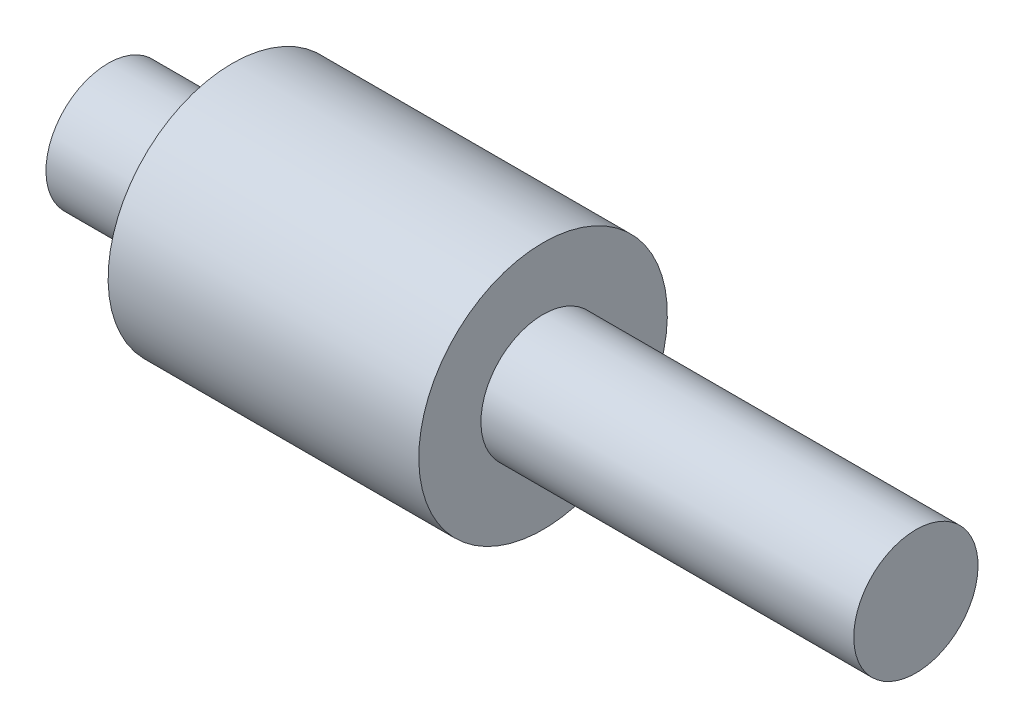
ISO-10303-21;
HEADER;
FILE_DESCRIPTION(('STEP AP214'),'2;1');
FILE_NAME('part.step','',(''),(''),'','','');
FILE_SCHEMA(('AUTOMOTIVE_DESIGN { 1 0 10303 214 1 1 1 1 }'));
ENDSEC;
DATA;
#1=APPLICATION_CONTEXT('core data for automotive mechanical design processes');
#2=APPLICATION_PROTOCOL_DEFINITION('international standard','automotive_design',2000,#1);
#3=PRODUCT_CONTEXT('',#1,'mechanical');
#4=PRODUCT('Part','Part','',(#3));
#5=PRODUCT_RELATED_PRODUCT_CATEGORY('part','',(#4));
#6=PRODUCT_DEFINITION_FORMATION('','',#4);
#7=PRODUCT_DEFINITION_CONTEXT('part definition',#1,'design');
#8=PRODUCT_DEFINITION('design','',#6,#7);
#9=PRODUCT_DEFINITION_SHAPE('','',#8);
#10=(LENGTH_UNIT() NAMED_UNIT(*) SI_UNIT(.MILLI.,.METRE.));
#11=(NAMED_UNIT(*) PLANE_ANGLE_UNIT() SI_UNIT($,.RADIAN.));
#12=(NAMED_UNIT(*) SI_UNIT($,.STERADIAN.) SOLID_ANGLE_UNIT());
#13=UNCERTAINTY_MEASURE_WITH_UNIT(LENGTH_MEASURE(1.E-05),#10,'distance_accuracy_value','');
#14=(GEOMETRIC_REPRESENTATION_CONTEXT(3) GLOBAL_UNCERTAINTY_ASSIGNED_CONTEXT((#13)) GLOBAL_UNIT_ASSIGNED_CONTEXT((#10,
#11,#12)) REPRESENTATION_CONTEXT('',''));
#15=CARTESIAN_POINT('',(0.,0.,0.));
#16=DIRECTION('',(0.,0.,1.));
#17=DIRECTION('',(1.,0.,0.));
#18=AXIS2_PLACEMENT_3D('',#15,#16,#17);
#19=CARTESIAN_POINT('',(-35.7684726351723,5.15464431230041,0.));
#20=DIRECTION('',(-1.,0.,0.));
#21=DIRECTION('',(0.,-1.,0.));
#22=AXIS2_PLACEMENT_3D('',#19,#20,#21);
#23=PLANE('',#22);
#24=CARTESIAN_POINT('',(-35.7684726351723,5.15464431230041,0.));
#25=DIRECTION('',(1.,0.,0.));
#26=DIRECTION('',(0.,1.,0.));
#27=AXIS2_PLACEMENT_3D('',#24,#25,#26);
#28=CIRCLE('',#27,3.175);
#29=CARTESIAN_POINT('',(-35.7684726351723,8.3296443123004,0.));
#30=VERTEX_POINT('',#29);
#31=EDGE_CURVE('E10',#30,#30,#28,.T.);
#32=ORIENTED_EDGE('',*,*,#31,.F.);
#33=EDGE_LOOP('',(#32));
#34=FACE_BOUND('',#33,.T.);
#35=ADVANCED_FACE('F29',(#34),#23,.T.);
#36=CARTESIAN_POINT('',(5.50652736482768,5.15464431230041,0.));
#37=DIRECTION('',(1.,0.,0.));
#38=DIRECTION('',(0.,1.,0.));
#39=AXIS2_PLACEMENT_3D('',#36,#37,#38);
#40=CYLINDRICAL_SURFACE('',#39,3.175);
#41=ORIENTED_EDGE('',*,*,#31,.T.);
#42=EDGE_LOOP('',(#41));
#43=FACE_BOUND('',#42,.T.);
#44=CARTESIAN_POINT('',(-29.4184726351723,5.15464431230041,0.));
#45=DIRECTION('',(1.,0.,0.));
#46=DIRECTION('',(0.,1.,0.));
#47=AXIS2_PLACEMENT_3D('',#44,#45,#46);
#48=CIRCLE('',#47,3.175);
#49=CARTESIAN_POINT('',(-29.4184726351723,8.3296443123004,0.));
#50=VERTEX_POINT('',#49);
#51=EDGE_CURVE('E35',#50,#50,#48,.T.);
#52=ORIENTED_EDGE('',*,*,#51,.F.);
#53=EDGE_LOOP('',(#52));
#54=FACE_BOUND('',#53,.T.);
#55=ADVANCED_FACE('F71',(#43,#54),#40,.T.);
#56=CARTESIAN_POINT('',(-29.4184726351723,8.3296443123004,0.));
#57=DIRECTION('',(-1.,0.,0.));
#58=DIRECTION('',(0.,-1.,0.));
#59=AXIS2_PLACEMENT_3D('',#56,#57,#58);
#60=PLANE('',#59);
#61=ORIENTED_EDGE('',*,*,#51,.T.);
#62=EDGE_LOOP('',(#61));
#63=FACE_BOUND('',#62,.T.);
#64=CARTESIAN_POINT('',(-29.4184726351723,5.15464431230041,0.));
#65=DIRECTION('',(1.,0.,0.));
#66=DIRECTION('',(0.,1.,0.));
#67=AXIS2_PLACEMENT_3D('',#64,#65,#66);
#68=CIRCLE('',#67,6.35);
#69=CARTESIAN_POINT('',(-29.4184726351723,11.5046443123004,0.));
#70=VERTEX_POINT('',#69);
#71=EDGE_CURVE('E39',#70,#70,#68,.T.);
#72=ORIENTED_EDGE('',*,*,#71,.F.);
#73=EDGE_LOOP('',(#72));
#74=FACE_BOUND('',#73,.T.);
#75=ADVANCED_FACE('F76',(#63,#74),#60,.T.);
#76=CARTESIAN_POINT('',(5.50652736482768,5.15464431230041,0.));
#77=DIRECTION('',(1.,0.,0.));
#78=DIRECTION('',(0.,1.,0.));
#79=AXIS2_PLACEMENT_3D('',#76,#77,#78);
#80=CYLINDRICAL_SURFACE('',#79,6.35);
#81=ORIENTED_EDGE('',*,*,#71,.T.);
#82=EDGE_LOOP('',(#81));
#83=FACE_BOUND('',#82,.T.);
#84=CARTESIAN_POINT('',(-13.5434726351723,5.15464431230041,0.));
#85=DIRECTION('',(1.,0.,0.));
#86=DIRECTION('',(0.,1.,0.));
#87=AXIS2_PLACEMENT_3D('',#84,#85,#86);
#88=CIRCLE('',#87,6.35);
#89=CARTESIAN_POINT('',(-13.5434726351723,11.5046443123004,0.));
#90=VERTEX_POINT('',#89);
#91=EDGE_CURVE('E43',#90,#90,#88,.T.);
#92=ORIENTED_EDGE('',*,*,#91,.F.);
#93=EDGE_LOOP('',(#92));
#94=FACE_BOUND('',#93,.T.);
#95=ADVANCED_FACE('F67',(#83,#94),#80,.T.);
#96=CARTESIAN_POINT('',(-13.5434726351723,11.5046443123004,0.));
#97=DIRECTION('',(1.,0.,0.));
#98=DIRECTION('',(0.,1.,0.));
#99=AXIS2_PLACEMENT_3D('',#96,#97,#98);
#100=PLANE('',#99);
#101=ORIENTED_EDGE('',*,*,#91,.T.);
#102=EDGE_LOOP('',(#101));
#103=FACE_BOUND('',#102,.T.);
#104=CARTESIAN_POINT('',(-13.5434726351723,5.15464431230041,0.));
#105=DIRECTION('',(1.,0.,0.));
#106=DIRECTION('',(0.,1.,0.));
#107=AXIS2_PLACEMENT_3D('',#104,#105,#106);
#108=CIRCLE('',#107,3.175);
#109=CARTESIAN_POINT('',(-13.5434726351723,8.3296443123004,0.));
#110=VERTEX_POINT('',#109);
#111=EDGE_CURVE('E48',#110,#110,#108,.T.);
#112=ORIENTED_EDGE('',*,*,#111,.F.);
#113=EDGE_LOOP('',(#112));
#114=FACE_BOUND('',#113,.T.);
#115=ADVANCED_FACE('F59',(#103,#114),#100,.T.);
#116=CARTESIAN_POINT('',(5.50652736482768,5.15464431230041,0.));
#117=DIRECTION('',(1.,0.,0.));
#118=DIRECTION('',(0.,1.,0.));
#119=AXIS2_PLACEMENT_3D('',#116,#117,#118);
#120=CYLINDRICAL_SURFACE('',#119,3.17499999999999);
#121=ORIENTED_EDGE('',*,*,#111,.T.);
#122=EDGE_LOOP('',(#121));
#123=FACE_BOUND('',#122,.T.);
#124=CARTESIAN_POINT('',(5.50652736482768,5.15464431230041,0.));
#125=DIRECTION('',(1.,0.,0.));
#126=DIRECTION('',(0.,1.,0.));
#127=AXIS2_PLACEMENT_3D('',#124,#125,#126);
#128=CIRCLE('',#127,3.17499999999999);
#129=CARTESIAN_POINT('',(5.50652736482768,8.3296443123004,0.));
#130=VERTEX_POINT('',#129);
#131=EDGE_CURVE('E51',#130,#130,#128,.T.);
#132=ORIENTED_EDGE('',*,*,#131,.F.);
#133=EDGE_LOOP('',(#132));
#134=FACE_BOUND('',#133,.T.);
#135=ADVANCED_FACE('F57',(#123,#134),#120,.T.);
#136=CARTESIAN_POINT('',(5.50652736482768,8.3296443123004,0.));
#137=DIRECTION('',(1.,0.,0.));
#138=DIRECTION('',(0.,1.,0.));
#139=AXIS2_PLACEMENT_3D('',#136,#137,#138);
#140=PLANE('',#139);
#141=ORIENTED_EDGE('',*,*,#131,.T.);
#142=EDGE_LOOP('',(#141));
#143=FACE_BOUND('',#142,.T.);
#144=ADVANCED_FACE('F55',(#143),#140,.T.);
#145=CLOSED_SHELL('',(#35,#55,#75,#95,#115,#135,#144));
#146=MANIFOLD_SOLID_BREP('B2',#145);
#147=ADVANCED_BREP_SHAPE_REPRESENTATION('',(#18,#146),#14);
#148=SHAPE_DEFINITION_REPRESENTATION(#9,#147);
ENDSEC;
END-ISO-10303-21;
